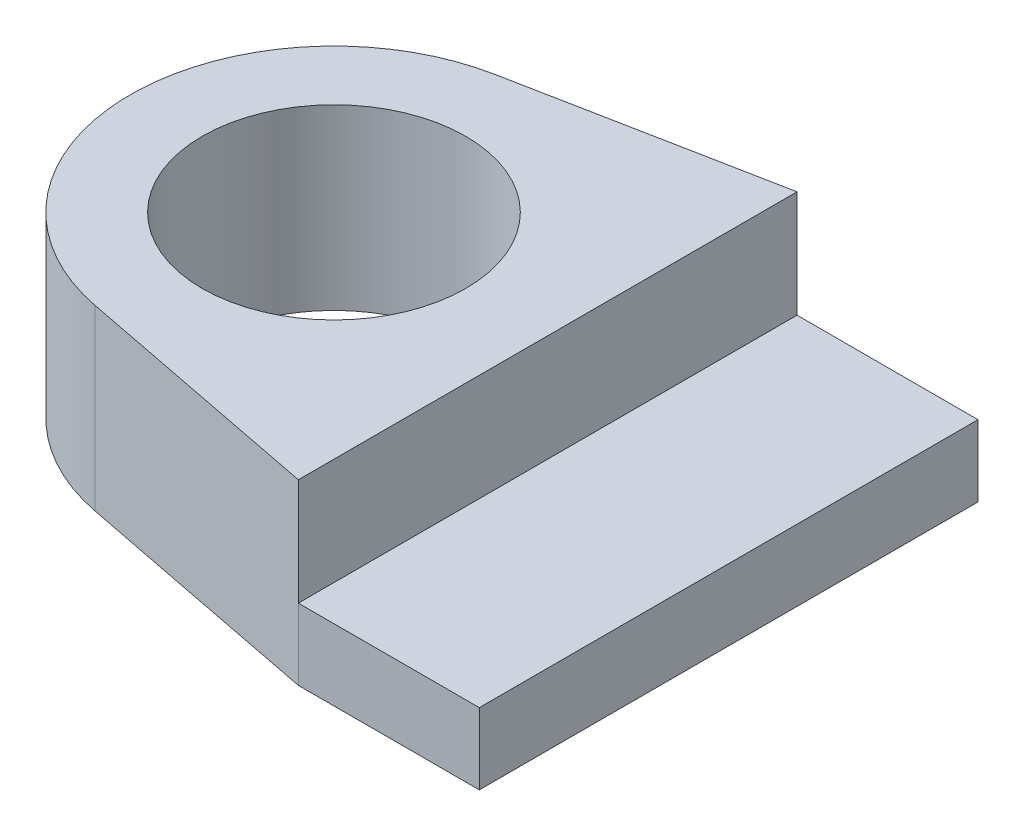
ISO-10303-21;
HEADER;
FILE_DESCRIPTION(('STEP AP214'),'2;1');
FILE_NAME('part.step','',(''),(''),'','','');
FILE_SCHEMA(('AUTOMOTIVE_DESIGN { 1 0 10303 214 1 1 1 1 }'));
ENDSEC;
DATA;
#1=APPLICATION_CONTEXT('core data for automotive mechanical design processes');
#2=APPLICATION_PROTOCOL_DEFINITION('international standard','automotive_design',2000,#1);
#3=PRODUCT_CONTEXT('',#1,'mechanical');
#4=PRODUCT('Part','Part','',(#3));
#5=PRODUCT_RELATED_PRODUCT_CATEGORY('part','',(#4));
#6=PRODUCT_DEFINITION_FORMATION('','',#4);
#7=PRODUCT_DEFINITION_CONTEXT('part definition',#1,'design');
#8=PRODUCT_DEFINITION('design','',#6,#7);
#9=PRODUCT_DEFINITION_SHAPE('','',#8);
#10=(LENGTH_UNIT() NAMED_UNIT(*) SI_UNIT(.MILLI.,.METRE.));
#11=(NAMED_UNIT(*) PLANE_ANGLE_UNIT() SI_UNIT($,.RADIAN.));
#12=(NAMED_UNIT(*) SI_UNIT($,.STERADIAN.) SOLID_ANGLE_UNIT());
#13=UNCERTAINTY_MEASURE_WITH_UNIT(LENGTH_MEASURE(1.E-05),#10,'distance_accuracy_value','');
#14=(GEOMETRIC_REPRESENTATION_CONTEXT(3) GLOBAL_UNCERTAINTY_ASSIGNED_CONTEXT((#13)) GLOBAL_UNIT_ASSIGNED_CONTEXT((#10,
#11,#12)) REPRESENTATION_CONTEXT('',''));
#15=CARTESIAN_POINT('',(0.,0.,0.));
#16=DIRECTION('',(0.,0.,1.));
#17=DIRECTION('',(1.,0.,0.));
#18=AXIS2_PLACEMENT_3D('',#15,#16,#17);
#19=CARTESIAN_POINT('',(-5.4825229090674,15.,-28.0695910649149));
#20=DIRECTION('',(0.191696605212147,0.,0.981454233038983));
#21=DIRECTION('',(0.981454233038983,0.,-0.191696605212147));
#22=AXIS2_PLACEMENT_3D('',#19,#20,#21);
#23=PLANE('',#22);
#24=DIRECTION('',(0.,-1.,0.));
#25=VECTOR('',#24,1.);
#26=CARTESIAN_POINT('',(30.,15.,-35.));
#27=LINE('',#26,#25);
#28=CARTESIAN_POINT('',(30.,15.,-35.));
#29=VERTEX_POINT('',#28);
#30=CARTESIAN_POINT('',(30.,0.,-35.));
#31=VERTEX_POINT('',#30);
#32=EDGE_CURVE('E152',#29,#31,#27,.T.);
#33=ORIENTED_EDGE('',*,*,#32,.T.);
#34=DIRECTION('',(0.,1.,0.));
#35=VECTOR('',#34,1.);
#36=CARTESIAN_POINT('',(30.,-10.,-35.));
#37=LINE('',#36,#35);
#38=CARTESIAN_POINT('',(30.,-10.,-35.));
#39=VERTEX_POINT('',#38);
#40=EDGE_CURVE('E108',#39,#31,#37,.T.);
#41=ORIENTED_EDGE('',*,*,#40,.F.);
#42=DIRECTION('',(-0.981454233038983,0.,0.191696605212147));
#43=VECTOR('',#42,1.);
#44=CARTESIAN_POINT('',(-5.4825229090674,-10.,-28.0695910649149));
#45=LINE('',#44,#43);
#46=CARTESIAN_POINT('',(-5.4825229090674,-10.,-28.0695910649149));
#47=VERTEX_POINT('',#46);
#48=EDGE_CURVE('E101',#39,#47,#45,.T.);
#49=ORIENTED_EDGE('',*,*,#48,.T.);
#50=DIRECTION('',(0.,-1.,0.));
#51=VECTOR('',#50,1.);
#52=CARTESIAN_POINT('',(-5.4825229090674,15.,-28.0695910649149));
#53=LINE('',#52,#51);
#54=CARTESIAN_POINT('',(-5.4825229090674,15.,-28.0695910649149));
#55=VERTEX_POINT('',#54);
#56=EDGE_CURVE('E11',#55,#47,#53,.T.);
#57=ORIENTED_EDGE('',*,*,#56,.F.);
#58=DIRECTION('',(-0.981454233038983,0.,0.191696605212147));
#59=VECTOR('',#58,1.);
#60=CARTESIAN_POINT('',(-5.4825229090674,15.,-28.0695910649149));
#61=LINE('',#60,#59);
#62=EDGE_CURVE('E145',#29,#55,#61,.T.);
#63=ORIENTED_EDGE('',*,*,#62,.F.);
#64=EDGE_LOOP('',(#33,#41,#49,#57,#63));
#65=FACE_BOUND('',#64,.T.);
#66=ADVANCED_FACE('F33',(#65),#23,.F.);
#67=CARTESIAN_POINT('',(0.,15.,0.));
#68=DIRECTION('',(0.,-1.,0.));
#69=DIRECTION('',(0.,0.,-1.));
#70=AXIS2_PLACEMENT_3D('',#67,#68,#69);
#71=CYLINDRICAL_SURFACE('',#70,28.6);
#72=ORIENTED_EDGE('',*,*,#56,.T.);
#73=CARTESIAN_POINT('',(0.,-10.,0.));
#74=DIRECTION('',(0.,1.,0.));
#75=DIRECTION('',(0.,0.,1.));
#76=AXIS2_PLACEMENT_3D('',#73,#74,#75);
#77=CIRCLE('',#76,28.6);
#78=CARTESIAN_POINT('',(-5.4825229090674,-10.,28.0695910649149));
#79=VERTEX_POINT('',#78);
#80=EDGE_CURVE('E91',#47,#79,#77,.T.);
#81=ORIENTED_EDGE('',*,*,#80,.T.);
#82=DIRECTION('',(0.,-1.,0.));
#83=VECTOR('',#82,1.);
#84=CARTESIAN_POINT('',(-5.4825229090674,15.,28.0695910649149));
#85=LINE('',#84,#83);
#86=CARTESIAN_POINT('',(-5.4825229090674,15.,28.0695910649149));
#87=VERTEX_POINT('',#86);
#88=EDGE_CURVE('E42',#87,#79,#85,.T.);
#89=ORIENTED_EDGE('',*,*,#88,.F.);
#90=CARTESIAN_POINT('',(0.,15.,0.));
#91=DIRECTION('',(0.,1.,0.));
#92=DIRECTION('',(0.,0.,1.));
#93=AXIS2_PLACEMENT_3D('',#90,#91,#92);
#94=CIRCLE('',#93,28.6);
#95=EDGE_CURVE('E92',#55,#87,#94,.T.);
#96=ORIENTED_EDGE('',*,*,#95,.F.);
#97=EDGE_LOOP('',(#72,#81,#89,#96));
#98=FACE_BOUND('',#97,.T.);
#99=ADVANCED_FACE('F89',(#98),#71,.T.);
#100=CARTESIAN_POINT('',(-5.48252290906741,15.,28.0695910649149));
#101=DIRECTION('',(-0.191696605212147,0.,0.981454233038983));
#102=DIRECTION('',(0.981454233038983,0.,0.191696605212147));
#103=AXIS2_PLACEMENT_3D('',#100,#101,#102);
#104=PLANE('',#103);
#105=ORIENTED_EDGE('',*,*,#88,.T.);
#106=DIRECTION('',(-0.981454233038983,0.,-0.191696605212147));
#107=VECTOR('',#106,1.);
#108=CARTESIAN_POINT('',(-5.48252290906741,-10.,28.0695910649149));
#109=LINE('',#108,#107);
#110=CARTESIAN_POINT('',(30.,-10.,35.));
#111=VERTEX_POINT('',#110);
#112=EDGE_CURVE('E104',#111,#79,#109,.T.);
#113=ORIENTED_EDGE('',*,*,#112,.F.);
#114=DIRECTION('',(0.,1.,0.));
#115=VECTOR('',#114,1.);
#116=CARTESIAN_POINT('',(30.,-10.,35.));
#117=LINE('',#116,#115);
#118=CARTESIAN_POINT('',(30.,0.,35.));
#119=VERTEX_POINT('',#118);
#120=EDGE_CURVE('E124',#111,#119,#117,.T.);
#121=ORIENTED_EDGE('',*,*,#120,.T.);
#122=DIRECTION('',(0.,-1.,0.));
#123=VECTOR('',#122,1.);
#124=CARTESIAN_POINT('',(30.,15.,35.));
#125=LINE('',#124,#123);
#126=CARTESIAN_POINT('',(30.,15.,35.));
#127=VERTEX_POINT('',#126);
#128=EDGE_CURVE('E156',#127,#119,#125,.T.);
#129=ORIENTED_EDGE('',*,*,#128,.F.);
#130=DIRECTION('',(-0.981454233038983,0.,-0.191696605212147));
#131=VECTOR('',#130,1.);
#132=CARTESIAN_POINT('',(-5.48252290906741,15.,28.0695910649149));
#133=LINE('',#132,#131);
#134=EDGE_CURVE('E148',#127,#87,#133,.T.);
#135=ORIENTED_EDGE('',*,*,#134,.T.);
#136=EDGE_LOOP('',(#105,#113,#121,#129,#135));
#137=FACE_BOUND('',#136,.T.);
#138=ADVANCED_FACE('F159',(#137),#104,.T.);
#139=CARTESIAN_POINT('',(0.,15.,0.));
#140=DIRECTION('',(0.,-1.,0.));
#141=DIRECTION('',(0.,0.,-1.));
#142=AXIS2_PLACEMENT_3D('',#139,#140,#141);
#143=CYLINDRICAL_SURFACE('',#142,18.5);
#144=CARTESIAN_POINT('',(0.,15.,0.));
#145=DIRECTION('',(0.,1.,0.));
#146=DIRECTION('',(0.,0.,1.));
#147=AXIS2_PLACEMENT_3D('',#144,#145,#146);
#148=CIRCLE('',#147,18.5);
#149=CARTESIAN_POINT('',(0.,15.,18.5));
#150=VERTEX_POINT('',#149);
#151=EDGE_CURVE('E142',#150,#150,#148,.T.);
#152=ORIENTED_EDGE('',*,*,#151,.T.);
#153=EDGE_LOOP('',(#152));
#154=FACE_BOUND('',#153,.T.);
#155=CARTESIAN_POINT('',(0.,-10.,0.));
#156=DIRECTION('',(0.,1.,0.));
#157=DIRECTION('',(0.,0.,1.));
#158=AXIS2_PLACEMENT_3D('',#155,#156,#157);
#159=CIRCLE('',#158,18.5);
#160=CARTESIAN_POINT('',(0.,-10.,18.5));
#161=VERTEX_POINT('',#160);
#162=EDGE_CURVE('E110',#161,#161,#159,.T.);
#163=ORIENTED_EDGE('',*,*,#162,.F.);
#164=EDGE_LOOP('',(#163));
#165=FACE_BOUND('',#164,.T.);
#166=ADVANCED_FACE('F35',(#154,#165),#143,.F.);
#167=CARTESIAN_POINT('',(30.,15.,0.));
#168=DIRECTION('',(-1.,0.,0.));
#169=DIRECTION('',(0.,0.,1.));
#170=AXIS2_PLACEMENT_3D('',#167,#168,#169);
#171=PLANE('',#170);
#172=DIRECTION('',(0.,0.,-1.));
#173=VECTOR('',#172,1.);
#174=CARTESIAN_POINT('',(30.,0.,0.));
#175=LINE('',#174,#173);
#176=EDGE_CURVE('E134',#119,#31,#175,.T.);
#177=ORIENTED_EDGE('',*,*,#176,.T.);
#178=ORIENTED_EDGE('',*,*,#32,.F.);
#179=DIRECTION('',(0.,0.,-1.));
#180=VECTOR('',#179,1.);
#181=CARTESIAN_POINT('',(30.,15.,0.));
#182=LINE('',#181,#180);
#183=EDGE_CURVE('E49',#127,#29,#182,.T.);
#184=ORIENTED_EDGE('',*,*,#183,.F.);
#185=ORIENTED_EDGE('',*,*,#128,.T.);
#186=EDGE_LOOP('',(#177,#178,#184,#185));
#187=FACE_BOUND('',#186,.T.);
#188=ADVANCED_FACE('F163',(#187),#171,.F.);
#189=CARTESIAN_POINT('',(0.,15.,0.));
#190=DIRECTION('',(0.,1.,0.));
#191=DIRECTION('',(0.,0.,1.));
#192=AXIS2_PLACEMENT_3D('',#189,#190,#191);
#193=PLANE('',#192);
#194=ORIENTED_EDGE('',*,*,#151,.F.);
#195=EDGE_LOOP('',(#194));
#196=FACE_BOUND('',#195,.T.);
#197=ORIENTED_EDGE('',*,*,#62,.T.);
#198=ORIENTED_EDGE('',*,*,#95,.T.);
#199=ORIENTED_EDGE('',*,*,#134,.F.);
#200=ORIENTED_EDGE('',*,*,#183,.T.);
#201=EDGE_LOOP('',(#197,#198,#199,#200));
#202=FACE_BOUND('',#201,.T.);
#203=ADVANCED_FACE('F160',(#196,#202),#193,.T.);
#204=CARTESIAN_POINT('',(0.,0.,0.));
#205=DIRECTION('',(0.,1.,0.));
#206=DIRECTION('',(0.,0.,1.));
#207=AXIS2_PLACEMENT_3D('',#204,#205,#206);
#208=PLANE('',#207);
#209=ORIENTED_EDGE('',*,*,#176,.F.);
#210=DIRECTION('',(1.,0.,0.));
#211=VECTOR('',#210,1.);
#212=CARTESIAN_POINT('',(0.,0.,35.));
#213=LINE('',#212,#211);
#214=CARTESIAN_POINT('',(55.4,0.,35.));
#215=VERTEX_POINT('',#214);
#216=EDGE_CURVE('E125',#119,#215,#213,.T.);
#217=ORIENTED_EDGE('',*,*,#216,.T.);
#218=DIRECTION('',(0.,0.,1.));
#219=VECTOR('',#218,1.);
#220=CARTESIAN_POINT('',(55.4,0.,0.));
#221=LINE('',#220,#219);
#222=CARTESIAN_POINT('',(55.4,0.,-35.));
#223=VERTEX_POINT('',#222);
#224=EDGE_CURVE('E128',#223,#215,#221,.T.);
#225=ORIENTED_EDGE('',*,*,#224,.F.);
#226=DIRECTION('',(1.,0.,0.));
#227=VECTOR('',#226,1.);
#228=CARTESIAN_POINT('',(0.,0.,-35.));
#229=LINE('',#228,#227);
#230=EDGE_CURVE('E113',#31,#223,#229,.T.);
#231=ORIENTED_EDGE('',*,*,#230,.F.);
#232=EDGE_LOOP('',(#209,#217,#225,#231));
#233=FACE_BOUND('',#232,.T.);
#234=ADVANCED_FACE('F165',(#233),#208,.T.);
#235=CARTESIAN_POINT('',(0.,-10.,-35.));
#236=DIRECTION('',(0.,0.,1.));
#237=DIRECTION('',(1.,0.,0.));
#238=AXIS2_PLACEMENT_3D('',#235,#236,#237);
#239=PLANE('',#238);
#240=ORIENTED_EDGE('',*,*,#230,.T.);
#241=DIRECTION('',(0.,1.,0.));
#242=VECTOR('',#241,1.);
#243=CARTESIAN_POINT('',(55.4,-10.,-35.));
#244=LINE('',#243,#242);
#245=CARTESIAN_POINT('',(55.4,-10.,-35.));
#246=VERTEX_POINT('',#245);
#247=EDGE_CURVE('E135',#246,#223,#244,.T.);
#248=ORIENTED_EDGE('',*,*,#247,.F.);
#249=DIRECTION('',(1.,0.,0.));
#250=VECTOR('',#249,1.);
#251=CARTESIAN_POINT('',(0.,-10.,-35.));
#252=LINE('',#251,#250);
#253=EDGE_CURVE('E122',#39,#246,#252,.T.);
#254=ORIENTED_EDGE('',*,*,#253,.F.);
#255=ORIENTED_EDGE('',*,*,#40,.T.);
#256=EDGE_LOOP('',(#240,#248,#254,#255));
#257=FACE_BOUND('',#256,.T.);
#258=ADVANCED_FACE('F174',(#257),#239,.F.);
#259=CARTESIAN_POINT('',(55.4,-10.,0.));
#260=DIRECTION('',(-1.,0.,0.));
#261=DIRECTION('',(0.,0.,1.));
#262=AXIS2_PLACEMENT_3D('',#259,#260,#261);
#263=PLANE('',#262);
#264=ORIENTED_EDGE('',*,*,#224,.T.);
#265=DIRECTION('',(0.,1.,0.));
#266=VECTOR('',#265,1.);
#267=CARTESIAN_POINT('',(55.4,-10.,35.));
#268=LINE('',#267,#266);
#269=CARTESIAN_POINT('',(55.4,-10.,35.));
#270=VERTEX_POINT('',#269);
#271=EDGE_CURVE('E138',#270,#215,#268,.T.);
#272=ORIENTED_EDGE('',*,*,#271,.F.);
#273=DIRECTION('',(0.,0.,1.));
#274=VECTOR('',#273,1.);
#275=CARTESIAN_POINT('',(55.4,-10.,0.));
#276=LINE('',#275,#274);
#277=EDGE_CURVE('E120',#246,#270,#276,.T.);
#278=ORIENTED_EDGE('',*,*,#277,.F.);
#279=ORIENTED_EDGE('',*,*,#247,.T.);
#280=EDGE_LOOP('',(#264,#272,#278,#279));
#281=FACE_BOUND('',#280,.T.);
#282=ADVANCED_FACE('F171',(#281),#263,.F.);
#283=CARTESIAN_POINT('',(0.,-10.,35.));
#284=DIRECTION('',(0.,0.,1.));
#285=DIRECTION('',(1.,0.,0.));
#286=AXIS2_PLACEMENT_3D('',#283,#284,#285);
#287=PLANE('',#286);
#288=ORIENTED_EDGE('',*,*,#216,.F.);
#289=ORIENTED_EDGE('',*,*,#120,.F.);
#290=DIRECTION('',(1.,0.,0.));
#291=VECTOR('',#290,1.);
#292=CARTESIAN_POINT('',(0.,-10.,35.));
#293=LINE('',#292,#291);
#294=EDGE_CURVE('E117',#111,#270,#293,.T.);
#295=ORIENTED_EDGE('',*,*,#294,.T.);
#296=ORIENTED_EDGE('',*,*,#271,.T.);
#297=EDGE_LOOP('',(#288,#289,#295,#296));
#298=FACE_BOUND('',#297,.T.);
#299=ADVANCED_FACE('F168',(#298),#287,.T.);
#300=CARTESIAN_POINT('',(0.,-10.,0.));
#301=DIRECTION('',(0.,1.,0.));
#302=DIRECTION('',(0.,0.,1.));
#303=AXIS2_PLACEMENT_3D('',#300,#301,#302);
#304=PLANE('',#303);
#305=ORIENTED_EDGE('',*,*,#162,.T.);
#306=EDGE_LOOP('',(#305));
#307=FACE_BOUND('',#306,.T.);
#308=ORIENTED_EDGE('',*,*,#48,.F.);
#309=ORIENTED_EDGE('',*,*,#253,.T.);
#310=ORIENTED_EDGE('',*,*,#277,.T.);
#311=ORIENTED_EDGE('',*,*,#294,.F.);
#312=ORIENTED_EDGE('',*,*,#112,.T.);
#313=ORIENTED_EDGE('',*,*,#80,.F.);
#314=EDGE_LOOP('',(#308,#309,#310,#311,#312,#313));
#315=FACE_BOUND('',#314,.T.);
#316=ADVANCED_FACE('F99',(#307,#315),#304,.F.);
#317=CLOSED_SHELL('',(#66,#99,#138,#166,#188,#203,#234,#258,#282,#299,#316));
#318=MANIFOLD_SOLID_BREP('B2',#317);
#319=ADVANCED_BREP_SHAPE_REPRESENTATION('',(#18,#318),#14);
#320=SHAPE_DEFINITION_REPRESENTATION(#9,#319);
ENDSEC;
END-ISO-10303-21;
